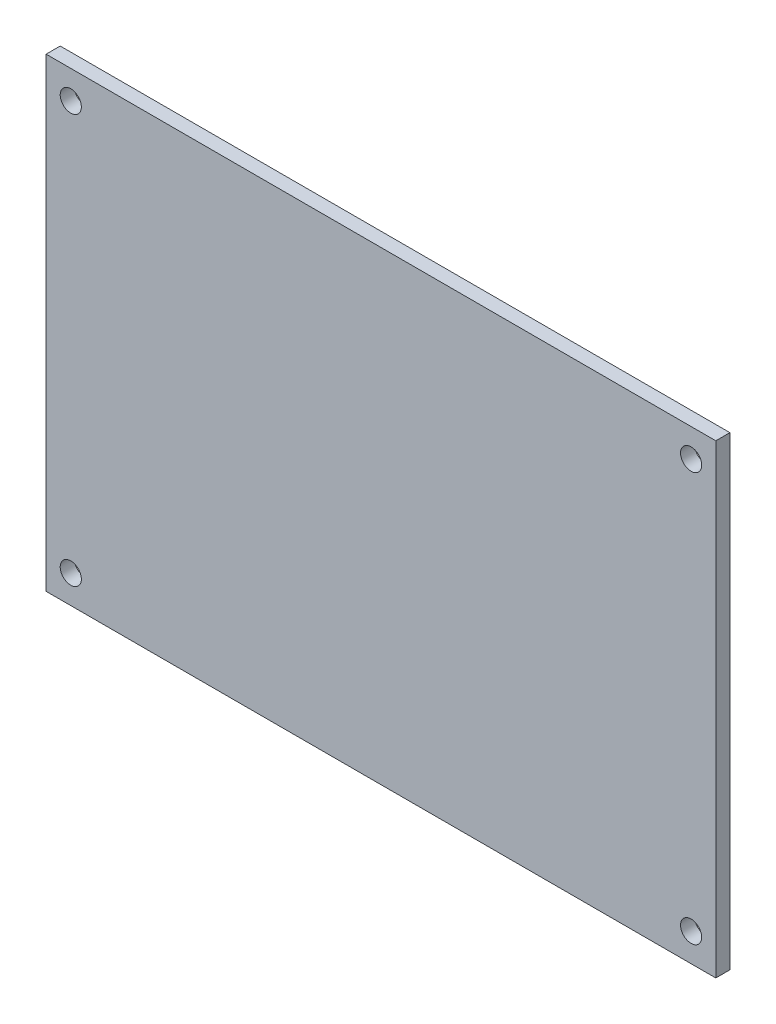
ISO-10303-21;
HEADER;
FILE_DESCRIPTION(('STEP AP214'),'2;1');
FILE_NAME('part.step','',(''),(''),'','','');
FILE_SCHEMA(('AUTOMOTIVE_DESIGN { 1 0 10303 214 1 1 1 1 }'));
ENDSEC;
DATA;
#1=APPLICATION_CONTEXT('core data for automotive mechanical design processes');
#2=APPLICATION_PROTOCOL_DEFINITION('international standard','automotive_design',2000,#1);
#3=PRODUCT_CONTEXT('',#1,'mechanical');
#4=PRODUCT('Part','Part','',(#3));
#5=PRODUCT_RELATED_PRODUCT_CATEGORY('part','',(#4));
#6=PRODUCT_DEFINITION_FORMATION('','',#4);
#7=PRODUCT_DEFINITION_CONTEXT('part definition',#1,'design');
#8=PRODUCT_DEFINITION('design','',#6,#7);
#9=PRODUCT_DEFINITION_SHAPE('','',#8);
#10=(LENGTH_UNIT() NAMED_UNIT(*) SI_UNIT(.MILLI.,.METRE.));
#11=(NAMED_UNIT(*) PLANE_ANGLE_UNIT() SI_UNIT($,.RADIAN.));
#12=(NAMED_UNIT(*) SI_UNIT($,.STERADIAN.) SOLID_ANGLE_UNIT());
#13=UNCERTAINTY_MEASURE_WITH_UNIT(LENGTH_MEASURE(1.E-05),#10,'distance_accuracy_value','');
#14=(GEOMETRIC_REPRESENTATION_CONTEXT(3) GLOBAL_UNCERTAINTY_ASSIGNED_CONTEXT((#13)) GLOBAL_UNIT_ASSIGNED_CONTEXT((#10,
#11,#12)) REPRESENTATION_CONTEXT('',''));
#15=CARTESIAN_POINT('',(0.,0.,0.));
#16=DIRECTION('',(0.,0.,1.));
#17=DIRECTION('',(1.,0.,0.));
#18=AXIS2_PLACEMENT_3D('',#15,#16,#17);
#19=CARTESIAN_POINT('',(-95.,66.,2.));
#20=DIRECTION('',(1.,0.,0.));
#21=DIRECTION('',(0.,0.,-1.));
#22=AXIS2_PLACEMENT_3D('',#19,#20,#21);
#23=PLANE('',#22);
#24=DIRECTION('',(0.,-1.,0.));
#25=VECTOR('',#24,1.);
#26=CARTESIAN_POINT('',(-95.,66.,0.));
#27=LINE('',#26,#25);
#28=CARTESIAN_POINT('',(-95.,66.,0.));
#29=VERTEX_POINT('',#28);
#30=CARTESIAN_POINT('',(-95.,0.,0.));
#31=VERTEX_POINT('',#30);
#32=EDGE_CURVE('E98',#29,#31,#27,.T.);
#33=ORIENTED_EDGE('',*,*,#32,.T.);
#34=DIRECTION('',(0.,0.,-1.));
#35=VECTOR('',#34,1.);
#36=CARTESIAN_POINT('',(-95.,0.,2.));
#37=LINE('',#36,#35);
#38=CARTESIAN_POINT('',(-95.,0.,2.));
#39=VERTEX_POINT('',#38);
#40=EDGE_CURVE('E11',#39,#31,#37,.T.);
#41=ORIENTED_EDGE('',*,*,#40,.F.);
#42=DIRECTION('',(0.,-1.,0.));
#43=VECTOR('',#42,1.);
#44=CARTESIAN_POINT('',(-95.,66.,2.));
#45=LINE('',#44,#43);
#46=CARTESIAN_POINT('',(-95.,66.,2.));
#47=VERTEX_POINT('',#46);
#48=EDGE_CURVE('E86',#47,#39,#45,.T.);
#49=ORIENTED_EDGE('',*,*,#48,.F.);
#50=DIRECTION('',(0.,0.,-1.));
#51=VECTOR('',#50,1.);
#52=CARTESIAN_POINT('',(-95.,66.,2.));
#53=LINE('',#52,#51);
#54=EDGE_CURVE('E94',#47,#29,#53,.T.);
#55=ORIENTED_EDGE('',*,*,#54,.T.);
#56=EDGE_LOOP('',(#33,#41,#49,#55));
#57=FACE_BOUND('',#56,.T.);
#58=ADVANCED_FACE('F35',(#57),#23,.F.);
#59=CARTESIAN_POINT('',(-95.,0.,2.));
#60=DIRECTION('',(0.,1.,0.));
#61=DIRECTION('',(0.,0.,1.));
#62=AXIS2_PLACEMENT_3D('',#59,#60,#61);
#63=PLANE('',#62);
#64=DIRECTION('',(1.,0.,0.));
#65=VECTOR('',#64,1.);
#66=CARTESIAN_POINT('',(-95.,0.,0.));
#67=LINE('',#66,#65);
#68=CARTESIAN_POINT('',(0.,0.,0.));
#69=VERTEX_POINT('',#68);
#70=EDGE_CURVE('E90',#31,#69,#67,.T.);
#71=ORIENTED_EDGE('',*,*,#70,.T.);
#72=DIRECTION('',(0.,0.,-1.));
#73=VECTOR('',#72,1.);
#74=CARTESIAN_POINT('',(0.,0.,2.));
#75=LINE('',#74,#73);
#76=CARTESIAN_POINT('',(0.,0.,2.));
#77=VERTEX_POINT('',#76);
#78=EDGE_CURVE('E43',#77,#69,#75,.T.);
#79=ORIENTED_EDGE('',*,*,#78,.F.);
#80=DIRECTION('',(1.,0.,0.));
#81=VECTOR('',#80,1.);
#82=CARTESIAN_POINT('',(-95.,0.,2.));
#83=LINE('',#82,#81);
#84=EDGE_CURVE('E81',#39,#77,#83,.T.);
#85=ORIENTED_EDGE('',*,*,#84,.F.);
#86=ORIENTED_EDGE('',*,*,#40,.T.);
#87=EDGE_LOOP('',(#71,#79,#85,#86));
#88=FACE_BOUND('',#87,.T.);
#89=ADVANCED_FACE('F89',(#88),#63,.F.);
#90=CARTESIAN_POINT('',(0.,66.,2.));
#91=DIRECTION('',(-1.,0.,0.));
#92=DIRECTION('',(0.,-1.,0.));
#93=AXIS2_PLACEMENT_3D('',#90,#91,#92);
#94=PLANE('',#93);
#95=DIRECTION('',(0.,1.,0.));
#96=VECTOR('',#95,1.);
#97=CARTESIAN_POINT('',(0.,66.,0.));
#98=LINE('',#97,#96);
#99=CARTESIAN_POINT('',(0.,66.,0.));
#100=VERTEX_POINT('',#99);
#101=EDGE_CURVE('E68',#69,#100,#98,.T.);
#102=ORIENTED_EDGE('',*,*,#101,.T.);
#103=DIRECTION('',(0.,0.,-1.));
#104=VECTOR('',#103,1.);
#105=CARTESIAN_POINT('',(0.,66.,2.));
#106=LINE('',#105,#104);
#107=CARTESIAN_POINT('',(0.,66.,2.));
#108=VERTEX_POINT('',#107);
#109=EDGE_CURVE('E91',#108,#100,#106,.T.);
#110=ORIENTED_EDGE('',*,*,#109,.F.);
#111=DIRECTION('',(0.,1.,0.));
#112=VECTOR('',#111,1.);
#113=CARTESIAN_POINT('',(0.,66.,2.));
#114=LINE('',#113,#112);
#115=EDGE_CURVE('E84',#77,#108,#114,.T.);
#116=ORIENTED_EDGE('',*,*,#115,.F.);
#117=ORIENTED_EDGE('',*,*,#78,.T.);
#118=EDGE_LOOP('',(#102,#110,#116,#117));
#119=FACE_BOUND('',#118,.T.);
#120=ADVANCED_FACE('F92',(#119),#94,.F.);
#121=CARTESIAN_POINT('',(-95.,66.,2.));
#122=DIRECTION('',(0.,-1.,0.));
#123=DIRECTION('',(0.,0.,-1.));
#124=AXIS2_PLACEMENT_3D('',#121,#122,#123);
#125=PLANE('',#124);
#126=DIRECTION('',(-1.,0.,0.));
#127=VECTOR('',#126,1.);
#128=CARTESIAN_POINT('',(-95.,66.,0.));
#129=LINE('',#128,#127);
#130=EDGE_CURVE('E74',#100,#29,#129,.T.);
#131=ORIENTED_EDGE('',*,*,#130,.T.);
#132=ORIENTED_EDGE('',*,*,#54,.F.);
#133=DIRECTION('',(-1.,0.,0.));
#134=VECTOR('',#133,1.);
#135=CARTESIAN_POINT('',(-95.,66.,2.));
#136=LINE('',#135,#134);
#137=EDGE_CURVE('E51',#108,#47,#136,.T.);
#138=ORIENTED_EDGE('',*,*,#137,.F.);
#139=ORIENTED_EDGE('',*,*,#109,.T.);
#140=EDGE_LOOP('',(#131,#132,#138,#139));
#141=FACE_BOUND('',#140,.T.);
#142=ADVANCED_FACE('F106',(#141),#125,.F.);
#143=CARTESIAN_POINT('',(0.,0.,2.));
#144=DIRECTION('',(0.,0.,1.));
#145=DIRECTION('',(1.,0.,0.));
#146=AXIS2_PLACEMENT_3D('',#143,#144,#145);
#147=PLANE('',#146);
#148=CARTESIAN_POINT('',(-91.5,4.,2.));
#149=DIRECTION('',(0.,0.,1.));
#150=DIRECTION('',(1.,0.,0.));
#151=AXIS2_PLACEMENT_3D('',#148,#149,#150);
#152=CIRCLE('',#151,1.5);
#153=CARTESIAN_POINT('',(-90.,4.,2.));
#154=VERTEX_POINT('',#153);
#155=EDGE_CURVE('E118',#154,#154,#152,.T.);
#156=ORIENTED_EDGE('',*,*,#155,.F.);
#157=EDGE_LOOP('',(#156));
#158=FACE_BOUND('',#157,.T.);
#159=CARTESIAN_POINT('',(-3.5,4.00000000000001,2.));
#160=DIRECTION('',(0.,0.,1.));
#161=DIRECTION('',(1.,0.,0.));
#162=AXIS2_PLACEMENT_3D('',#159,#160,#161);
#163=CIRCLE('',#162,1.5);
#164=CARTESIAN_POINT('',(-2.,4.00000000000001,2.));
#165=VERTEX_POINT('',#164);
#166=EDGE_CURVE('E124',#165,#165,#163,.T.);
#167=ORIENTED_EDGE('',*,*,#166,.F.);
#168=EDGE_LOOP('',(#167));
#169=FACE_BOUND('',#168,.T.);
#170=CARTESIAN_POINT('',(-3.5,62.,2.));
#171=DIRECTION('',(0.,0.,1.));
#172=DIRECTION('',(1.,0.,0.));
#173=AXIS2_PLACEMENT_3D('',#170,#171,#172);
#174=CIRCLE('',#173,1.5);
#175=CARTESIAN_POINT('',(-2.,62.,2.));
#176=VERTEX_POINT('',#175);
#177=EDGE_CURVE('E130',#176,#176,#174,.T.);
#178=ORIENTED_EDGE('',*,*,#177,.F.);
#179=EDGE_LOOP('',(#178));
#180=FACE_BOUND('',#179,.T.);
#181=CARTESIAN_POINT('',(-91.5,62.,2.));
#182=DIRECTION('',(0.,0.,1.));
#183=DIRECTION('',(1.,0.,0.));
#184=AXIS2_PLACEMENT_3D('',#181,#182,#183);
#185=CIRCLE('',#184,1.5);
#186=CARTESIAN_POINT('',(-90.,62.,2.));
#187=VERTEX_POINT('',#186);
#188=EDGE_CURVE('E112',#187,#187,#185,.T.);
#189=ORIENTED_EDGE('',*,*,#188,.F.);
#190=EDGE_LOOP('',(#189));
#191=FACE_BOUND('',#190,.T.);
#192=ORIENTED_EDGE('',*,*,#48,.T.);
#193=ORIENTED_EDGE('',*,*,#84,.T.);
#194=ORIENTED_EDGE('',*,*,#115,.T.);
#195=ORIENTED_EDGE('',*,*,#137,.T.);
#196=EDGE_LOOP('',(#192,#193,#194,#195));
#197=FACE_BOUND('',#196,.T.);
#198=ADVANCED_FACE('F82',(#158,#169,#180,#191,#197),#147,.T.);
#199=CARTESIAN_POINT('',(0.,0.,0.));
#200=DIRECTION('',(0.,0.,1.));
#201=DIRECTION('',(1.,0.,0.));
#202=AXIS2_PLACEMENT_3D('',#199,#200,#201);
#203=PLANE('',#202);
#204=CARTESIAN_POINT('',(-91.5,4.,0.));
#205=DIRECTION('',(0.,0.,1.));
#206=DIRECTION('',(1.,0.,0.));
#207=AXIS2_PLACEMENT_3D('',#204,#205,#206);
#208=CIRCLE('',#207,1.5);
#209=CARTESIAN_POINT('',(-90.,4.,0.));
#210=VERTEX_POINT('',#209);
#211=EDGE_CURVE('E121',#210,#210,#208,.T.);
#212=ORIENTED_EDGE('',*,*,#211,.T.);
#213=EDGE_LOOP('',(#212));
#214=FACE_BOUND('',#213,.T.);
#215=CARTESIAN_POINT('',(-3.5,4.00000000000001,0.));
#216=DIRECTION('',(0.,0.,1.));
#217=DIRECTION('',(1.,0.,0.));
#218=AXIS2_PLACEMENT_3D('',#215,#216,#217);
#219=CIRCLE('',#218,1.5);
#220=CARTESIAN_POINT('',(-2.,4.00000000000001,0.));
#221=VERTEX_POINT('',#220);
#222=EDGE_CURVE('E127',#221,#221,#219,.T.);
#223=ORIENTED_EDGE('',*,*,#222,.T.);
#224=EDGE_LOOP('',(#223));
#225=FACE_BOUND('',#224,.T.);
#226=CARTESIAN_POINT('',(-3.5,62.,0.));
#227=DIRECTION('',(0.,0.,1.));
#228=DIRECTION('',(1.,0.,0.));
#229=AXIS2_PLACEMENT_3D('',#226,#227,#228);
#230=CIRCLE('',#229,1.5);
#231=CARTESIAN_POINT('',(-2.,62.,0.));
#232=VERTEX_POINT('',#231);
#233=EDGE_CURVE('E115',#232,#232,#230,.T.);
#234=ORIENTED_EDGE('',*,*,#233,.T.);
#235=EDGE_LOOP('',(#234));
#236=FACE_BOUND('',#235,.T.);
#237=CARTESIAN_POINT('',(-91.5,62.,0.));
#238=DIRECTION('',(0.,0.,1.));
#239=DIRECTION('',(1.,0.,0.));
#240=AXIS2_PLACEMENT_3D('',#237,#238,#239);
#241=CIRCLE('',#240,1.5);
#242=CARTESIAN_POINT('',(-90.,62.,0.));
#243=VERTEX_POINT('',#242);
#244=EDGE_CURVE('E101',#243,#243,#241,.T.);
#245=ORIENTED_EDGE('',*,*,#244,.T.);
#246=EDGE_LOOP('',(#245));
#247=FACE_BOUND('',#246,.T.);
#248=ORIENTED_EDGE('',*,*,#32,.F.);
#249=ORIENTED_EDGE('',*,*,#130,.F.);
#250=ORIENTED_EDGE('',*,*,#101,.F.);
#251=ORIENTED_EDGE('',*,*,#70,.F.);
#252=EDGE_LOOP('',(#248,#249,#250,#251));
#253=FACE_BOUND('',#252,.T.);
#254=ADVANCED_FACE('F109',(#214,#225,#236,#247,#253),#203,.F.);
#255=CARTESIAN_POINT('',(-91.5,62.,0.));
#256=DIRECTION('',(0.,0.,1.));
#257=DIRECTION('',(1.,0.,0.));
#258=AXIS2_PLACEMENT_3D('',#255,#256,#257);
#259=CYLINDRICAL_SURFACE('',#258,1.5);
#260=ORIENTED_EDGE('',*,*,#244,.F.);
#261=EDGE_LOOP('',(#260));
#262=FACE_BOUND('',#261,.T.);
#263=ORIENTED_EDGE('',*,*,#188,.T.);
#264=EDGE_LOOP('',(#263));
#265=FACE_BOUND('',#264,.T.);
#266=ADVANCED_FACE('F142',(#262,#265),#259,.F.);
#267=CARTESIAN_POINT('',(-3.5,62.,0.));
#268=DIRECTION('',(0.,0.,1.));
#269=DIRECTION('',(1.,0.,0.));
#270=AXIS2_PLACEMENT_3D('',#267,#268,#269);
#271=CYLINDRICAL_SURFACE('',#270,1.5);
#272=ORIENTED_EDGE('',*,*,#233,.F.);
#273=EDGE_LOOP('',(#272));
#274=FACE_BOUND('',#273,.T.);
#275=ORIENTED_EDGE('',*,*,#177,.T.);
#276=EDGE_LOOP('',(#275));
#277=FACE_BOUND('',#276,.T.);
#278=ADVANCED_FACE('F138',(#274,#277),#271,.F.);
#279=CARTESIAN_POINT('',(-3.5,4.00000000000001,0.));
#280=DIRECTION('',(0.,0.,1.));
#281=DIRECTION('',(1.,0.,0.));
#282=AXIS2_PLACEMENT_3D('',#279,#280,#281);
#283=CYLINDRICAL_SURFACE('',#282,1.5);
#284=ORIENTED_EDGE('',*,*,#222,.F.);
#285=EDGE_LOOP('',(#284));
#286=FACE_BOUND('',#285,.T.);
#287=ORIENTED_EDGE('',*,*,#166,.T.);
#288=EDGE_LOOP('',(#287));
#289=FACE_BOUND('',#288,.T.);
#290=ADVANCED_FACE('F141',(#286,#289),#283,.F.);
#291=CARTESIAN_POINT('',(-91.5,4.,0.));
#292=DIRECTION('',(0.,0.,1.));
#293=DIRECTION('',(1.,0.,0.));
#294=AXIS2_PLACEMENT_3D('',#291,#292,#293);
#295=CYLINDRICAL_SURFACE('',#294,1.5);
#296=ORIENTED_EDGE('',*,*,#211,.F.);
#297=EDGE_LOOP('',(#296));
#298=FACE_BOUND('',#297,.T.);
#299=ORIENTED_EDGE('',*,*,#155,.T.);
#300=EDGE_LOOP('',(#299));
#301=FACE_BOUND('',#300,.T.);
#302=ADVANCED_FACE('F203',(#298,#301),#295,.F.);
#303=CLOSED_SHELL('',(#58,#89,#120,#142,#198,#254,#266,#278,#290,#302));
#304=MANIFOLD_SOLID_BREP('B2',#303);
#305=ADVANCED_BREP_SHAPE_REPRESENTATION('',(#18,#304),#14);
#306=SHAPE_DEFINITION_REPRESENTATION(#9,#305);
ENDSEC;
END-ISO-10303-21;
